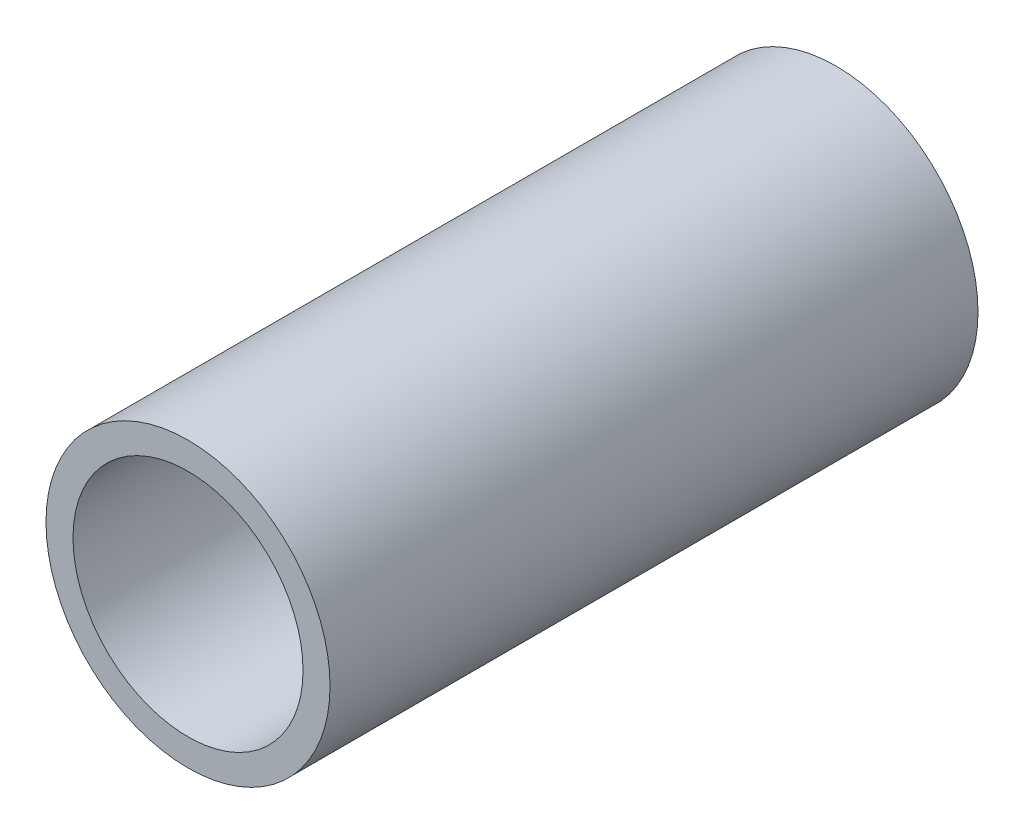
ISO-10303-21;
HEADER;
FILE_DESCRIPTION(('STEP AP214'),'2;1');
FILE_NAME('part.step','',(''),(''),'','','');
FILE_SCHEMA(('AUTOMOTIVE_DESIGN { 1 0 10303 214 1 1 1 1 }'));
ENDSEC;
DATA;
#1=APPLICATION_CONTEXT('core data for automotive mechanical design processes');
#2=APPLICATION_PROTOCOL_DEFINITION('international standard','automotive_design',2000,#1);
#3=PRODUCT_CONTEXT('',#1,'mechanical');
#4=PRODUCT('Part','Part','',(#3));
#5=PRODUCT_RELATED_PRODUCT_CATEGORY('part','',(#4));
#6=PRODUCT_DEFINITION_FORMATION('','',#4);
#7=PRODUCT_DEFINITION_CONTEXT('part definition',#1,'design');
#8=PRODUCT_DEFINITION('design','',#6,#7);
#9=PRODUCT_DEFINITION_SHAPE('','',#8);
#10=(LENGTH_UNIT() NAMED_UNIT(*) SI_UNIT(.MILLI.,.METRE.));
#11=(NAMED_UNIT(*) PLANE_ANGLE_UNIT() SI_UNIT($,.RADIAN.));
#12=(NAMED_UNIT(*) SI_UNIT($,.STERADIAN.) SOLID_ANGLE_UNIT());
#13=UNCERTAINTY_MEASURE_WITH_UNIT(LENGTH_MEASURE(1.E-05),#10,'distance_accuracy_value','');
#14=(GEOMETRIC_REPRESENTATION_CONTEXT(3) GLOBAL_UNCERTAINTY_ASSIGNED_CONTEXT((#13)) GLOBAL_UNIT_ASSIGNED_CONTEXT((#10,
#11,#12)) REPRESENTATION_CONTEXT('',''));
#15=CARTESIAN_POINT('',(0.,0.,0.));
#16=DIRECTION('',(0.,0.,1.));
#17=DIRECTION('',(1.,0.,0.));
#18=AXIS2_PLACEMENT_3D('',#15,#16,#17);
#19=CARTESIAN_POINT('',(0.,0.,76.2));
#20=DIRECTION('',(0.,0.,1.));
#21=DIRECTION('',(1.,0.,0.));
#22=AXIS2_PLACEMENT_3D('',#19,#20,#21);
#23=PLANE('',#22);
#24=CARTESIAN_POINT('',(0.,0.,76.2));
#25=DIRECTION('',(0.,0.,1.));
#26=DIRECTION('',(1.,0.,0.));
#27=AXIS2_PLACEMENT_3D('',#24,#25,#26);
#28=CIRCLE('',#27,16.7005);
#29=CARTESIAN_POINT('',(16.7005,0.,76.2));
#30=VERTEX_POINT('',#29);
#31=EDGE_CURVE('E11',#30,#30,#28,.T.);
#32=ORIENTED_EDGE('',*,*,#31,.T.);
#33=EDGE_LOOP('',(#32));
#34=FACE_BOUND('',#33,.T.);
#35=CARTESIAN_POINT('',(0.,0.,76.2));
#36=DIRECTION('',(0.,0.,1.));
#37=DIRECTION('',(1.,0.,0.));
#38=AXIS2_PLACEMENT_3D('',#35,#36,#37);
#39=CIRCLE('',#38,13.5255);
#40=CARTESIAN_POINT('',(13.5255,0.,76.2));
#41=VERTEX_POINT('',#40);
#42=EDGE_CURVE('E47',#41,#41,#39,.T.);
#43=ORIENTED_EDGE('',*,*,#42,.F.);
#44=EDGE_LOOP('',(#43));
#45=FACE_BOUND('',#44,.T.);
#46=ADVANCED_FACE('F36',(#34,#45),#23,.T.);
#47=CARTESIAN_POINT('',(0.,0.,0.));
#48=DIRECTION('',(0.,0.,1.));
#49=DIRECTION('',(1.,0.,0.));
#50=AXIS2_PLACEMENT_3D('',#47,#48,#49);
#51=PLANE('',#50);
#52=CARTESIAN_POINT('',(0.,0.,0.));
#53=DIRECTION('',(0.,0.,1.));
#54=DIRECTION('',(1.,0.,0.));
#55=AXIS2_PLACEMENT_3D('',#52,#53,#54);
#56=CIRCLE('',#55,16.7005);
#57=CARTESIAN_POINT('',(16.7005,0.,0.));
#58=VERTEX_POINT('',#57);
#59=EDGE_CURVE('E40',#58,#58,#56,.T.);
#60=ORIENTED_EDGE('',*,*,#59,.F.);
#61=EDGE_LOOP('',(#60));
#62=FACE_BOUND('',#61,.T.);
#63=CARTESIAN_POINT('',(0.,0.,0.));
#64=DIRECTION('',(0.,0.,1.));
#65=DIRECTION('',(1.,0.,0.));
#66=AXIS2_PLACEMENT_3D('',#63,#64,#65);
#67=CIRCLE('',#66,13.5255);
#68=CARTESIAN_POINT('',(13.5255,0.,0.));
#69=VERTEX_POINT('',#68);
#70=EDGE_CURVE('E49',#69,#69,#67,.T.);
#71=ORIENTED_EDGE('',*,*,#70,.T.);
#72=EDGE_LOOP('',(#71));
#73=FACE_BOUND('',#72,.T.);
#74=ADVANCED_FACE('F59',(#62,#73),#51,.F.);
#75=CARTESIAN_POINT('',(0.,0.,76.2));
#76=DIRECTION('',(0.,0.,-1.));
#77=DIRECTION('',(-1.,0.,0.));
#78=AXIS2_PLACEMENT_3D('',#75,#76,#77);
#79=CYLINDRICAL_SURFACE('',#78,16.7005);
#80=ORIENTED_EDGE('',*,*,#31,.F.);
#81=EDGE_LOOP('',(#80));
#82=FACE_BOUND('',#81,.T.);
#83=ORIENTED_EDGE('',*,*,#59,.T.);
#84=EDGE_LOOP('',(#83));
#85=FACE_BOUND('',#84,.T.);
#86=ADVANCED_FACE('F38',(#82,#85),#79,.T.);
#87=CARTESIAN_POINT('',(0.,0.,76.2));
#88=DIRECTION('',(0.,0.,-1.));
#89=DIRECTION('',(-1.,0.,0.));
#90=AXIS2_PLACEMENT_3D('',#87,#88,#89);
#91=CYLINDRICAL_SURFACE('',#90,13.5255);
#92=ORIENTED_EDGE('',*,*,#42,.T.);
#93=EDGE_LOOP('',(#92));
#94=FACE_BOUND('',#93,.T.);
#95=ORIENTED_EDGE('',*,*,#70,.F.);
#96=EDGE_LOOP('',(#95));
#97=FACE_BOUND('',#96,.T.);
#98=ADVANCED_FACE('F55',(#94,#97),#91,.F.);
#99=CLOSED_SHELL('',(#46,#74,#86,#98));
#100=MANIFOLD_SOLID_BREP('B2',#99);
#101=ADVANCED_BREP_SHAPE_REPRESENTATION('',(#18,#100),#14);
#102=SHAPE_DEFINITION_REPRESENTATION(#9,#101);
ENDSEC;
END-ISO-10303-21;
